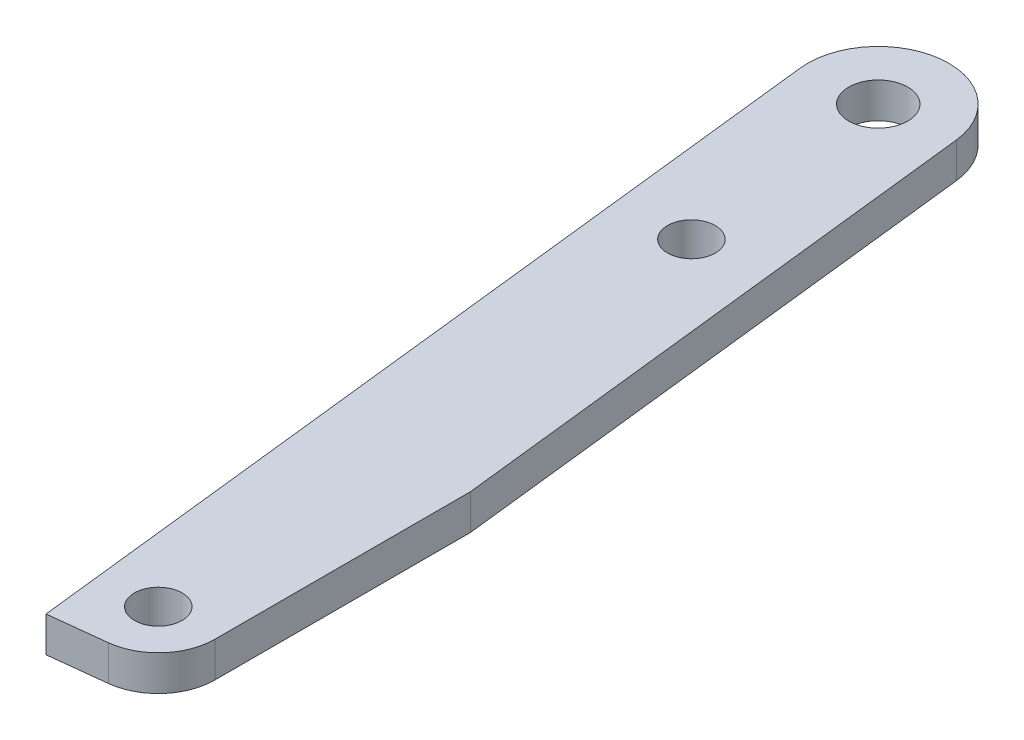
ISO-10303-21;
HEADER;
FILE_DESCRIPTION(('STEP AP214'),'2;1');
FILE_NAME('part.step','',(''),(''),'','','');
FILE_SCHEMA(('AUTOMOTIVE_DESIGN { 1 0 10303 214 1 1 1 1 }'));
ENDSEC;
DATA;
#1=APPLICATION_CONTEXT('core data for automotive mechanical design processes');
#2=APPLICATION_PROTOCOL_DEFINITION('international standard','automotive_design',2000,#1);
#3=PRODUCT_CONTEXT('',#1,'mechanical');
#4=PRODUCT('Part','Part','',(#3));
#5=PRODUCT_RELATED_PRODUCT_CATEGORY('part','',(#4));
#6=PRODUCT_DEFINITION_FORMATION('','',#4);
#7=PRODUCT_DEFINITION_CONTEXT('part definition',#1,'design');
#8=PRODUCT_DEFINITION('design','',#6,#7);
#9=PRODUCT_DEFINITION_SHAPE('','',#8);
#10=(LENGTH_UNIT() NAMED_UNIT(*) SI_UNIT(.MILLI.,.METRE.));
#11=(NAMED_UNIT(*) PLANE_ANGLE_UNIT() SI_UNIT($,.RADIAN.));
#12=(NAMED_UNIT(*) SI_UNIT($,.STERADIAN.) SOLID_ANGLE_UNIT());
#13=UNCERTAINTY_MEASURE_WITH_UNIT(LENGTH_MEASURE(1.E-05),#10,'distance_accuracy_value','');
#14=(GEOMETRIC_REPRESENTATION_CONTEXT(3) GLOBAL_UNCERTAINTY_ASSIGNED_CONTEXT((#13)) GLOBAL_UNIT_ASSIGNED_CONTEXT((#10,
#11,#12)) REPRESENTATION_CONTEXT('',''));
#15=CARTESIAN_POINT('',(0.,0.,0.));
#16=DIRECTION('',(0.,0.,1.));
#17=DIRECTION('',(1.,0.,0.));
#18=AXIS2_PLACEMENT_3D('',#15,#16,#17);
#19=CARTESIAN_POINT('',(-16.7204999999893,-18.4375000000001,72.4945922294544));
#20=DIRECTION('',(0.,1.,0.));
#21=DIRECTION('',(0.,0.,1.));
#22=AXIS2_PLACEMENT_3D('',#19,#20,#21);
#23=PLANE('',#22);
#24=CARTESIAN_POINT('',(-19.4709999999786,-18.4375000000001,37.1094));
#25=DIRECTION('',(0.,1.,0.));
#26=DIRECTION('',(0.,0.,1.));
#27=AXIS2_PLACEMENT_3D('',#24,#25,#26);
#28=CIRCLE('',#27,2.6543);
#29=CARTESIAN_POINT('',(-19.4709999999786,-18.4375000000001,39.7637));
#30=VERTEX_POINT('',#29);
#31=EDGE_CURVE('E105',#30,#30,#28,.T.);
#32=ORIENTED_EDGE('',*,*,#31,.T.);
#33=EDGE_LOOP('',(#32));
#34=FACE_BOUND('',#33,.T.);
#35=CARTESIAN_POINT('',(-17.3400495431374,-18.4375000000001,56.0398397293865));
#36=DIRECTION('',(0.,1.,0.));
#37=DIRECTION('',(0.,0.,1.));
#38=AXIS2_PLACEMENT_3D('',#35,#36,#37);
#39=CIRCLE('',#38,2.1463);
#40=CARTESIAN_POINT('',(-17.3400495431374,-18.4375000000001,58.1861397293865));
#41=VERTEX_POINT('',#40);
#42=EDGE_CURVE('E188',#41,#41,#39,.T.);
#43=ORIENTED_EDGE('',*,*,#42,.T.);
#44=EDGE_LOOP('',(#43));
#45=FACE_BOUND('',#44,.T.);
#46=CARTESIAN_POINT('',(-12.7000000000016,-18.4375000000001,108.613413739759));
#47=DIRECTION('',(0.,1.,0.));
#48=DIRECTION('',(0.,0.,1.));
#49=AXIS2_PLACEMENT_3D('',#46,#47,#48);
#50=CIRCLE('',#49,2.1463);
#51=CARTESIAN_POINT('',(-12.7000000000016,-18.4375000000001,110.759713739759));
#52=VERTEX_POINT('',#51);
#53=EDGE_CURVE('E113',#52,#52,#50,.T.);
#54=ORIENTED_EDGE('',*,*,#53,.T.);
#55=EDGE_LOOP('',(#54));
#56=FACE_BOUND('',#55,.T.);
#57=DIRECTION('',(-0.111860914179491,0.,-0.993723873054748));
#58=VECTOR('',#57,1.);
#59=CARTESIAN_POINT('',(-7.61999999999997,-18.4375000000001,85.6216230526662));
#60=LINE('',#59,#58);
#61=CARTESIAN_POINT('',(-7.61999999999998,-18.4375000000001,85.6216230526662));
#62=VERTEX_POINT('',#61);
#63=CARTESIAN_POINT('',(-13.1608534113733,-18.4375000000001,36.399083147946));
#64=VERTEX_POINT('',#63);
#65=EDGE_CURVE('E70',#62,#64,#60,.T.);
#66=ORIENTED_EDGE('',*,*,#65,.F.);
#67=DIRECTION('',(0.,0.,-1.));
#68=VECTOR('',#67,1.);
#69=CARTESIAN_POINT('',(-7.62000000000157,-18.4375000000001,108.613413739759));
#70=LINE('',#69,#68);
#71=CARTESIAN_POINT('',(-7.62000000000157,-18.4375000000001,108.61341373976));
#72=VERTEX_POINT('',#71);
#73=EDGE_CURVE('E111',#72,#62,#70,.T.);
#74=ORIENTED_EDGE('',*,*,#73,.F.);
#75=CARTESIAN_POINT('',(-12.7000000000016,-18.4375000000001,108.613413739759));
#76=DIRECTION('',(0.,1.,0.));
#77=DIRECTION('',(0.,0.,1.));
#78=AXIS2_PLACEMENT_3D('',#75,#76,#77);
#79=CIRCLE('',#78,5.08);
#80=CARTESIAN_POINT('',(-12.1317465559699,-18.4375000000001,113.661531014877));
#81=VERTEX_POINT('',#80);
#82=EDGE_CURVE('E145',#81,#72,#79,.T.);
#83=ORIENTED_EDGE('',*,*,#82,.F.);
#84=DIRECTION('',(0.99372387305475,0.,-0.11186091417947));
#85=VECTOR('',#84,1.);
#86=CARTESIAN_POINT('',(-17.179863831088,-18.4375000000001,114.229784458909));
#87=LINE('',#86,#85);
#88=CARTESIAN_POINT('',(-17.179863831088,-18.4375000000001,114.229784458909));
#89=VERTEX_POINT('',#88);
#90=EDGE_CURVE('E153',#89,#81,#87,.T.);
#91=ORIENTED_EDGE('',*,*,#90,.F.);
#92=DIRECTION('',(0.111860914179471,0.,0.99372387305475));
#93=VECTOR('',#92,1.);
#94=CARTESIAN_POINT('',(-25.7811465938762,-18.4375000000001,37.8197168050397));
#95=LINE('',#94,#93);
#96=CARTESIAN_POINT('',(-25.7811465960684,-18.4375000000001,37.8197167855657));
#97=VERTEX_POINT('',#96);
#98=EDGE_CURVE('E84',#97,#89,#95,.T.);
#99=ORIENTED_EDGE('',*,*,#98,.F.);
#100=CARTESIAN_POINT('',(-19.4709999999786,-18.4375000000001,37.1094));
#101=DIRECTION('',(0.,1.,0.));
#102=DIRECTION('',(0.,0.,1.));
#103=AXIS2_PLACEMENT_3D('',#100,#101,#102);
#104=CIRCLE('',#103,6.35);
#105=EDGE_CURVE('E20',#64,#97,#104,.T.);
#106=ORIENTED_EDGE('',*,*,#105,.F.);
#107=EDGE_LOOP('',(#66,#74,#83,#91,#99,#106));
#108=FACE_BOUND('',#107,.T.);
#109=ADVANCED_FACE('F17',(#34,#45,#56,#108),#23,.F.);
#110=CARTESIAN_POINT('',(-7.61999999999997,-18.4375000000001,85.6216230526662));
#111=DIRECTION('',(0.993723873054748,0.,-0.111860914179491));
#112=DIRECTION('',(-0.111860914179491,0.,-0.993723873054748));
#113=AXIS2_PLACEMENT_3D('',#110,#111,#112);
#114=PLANE('',#113);
#115=ORIENTED_EDGE('',*,*,#65,.T.);
#116=DIRECTION('',(0.,1.,0.));
#117=VECTOR('',#116,1.);
#118=CARTESIAN_POINT('',(-13.1608534166655,-18.4375000000001,36.3990831009318));
#119=LINE('',#118,#117);
#120=CARTESIAN_POINT('',(-13.1608534113733,-15.2624999999999,36.399083147946));
#121=VERTEX_POINT('',#120);
#122=EDGE_CURVE('E98',#121,#64,#119,.F.);
#123=ORIENTED_EDGE('',*,*,#122,.F.);
#124=DIRECTION('',(-0.111860914179491,0.,-0.993723873054748));
#125=VECTOR('',#124,1.);
#126=CARTESIAN_POINT('',(-7.61999999999997,-15.2624999999999,85.6216230526662));
#127=LINE('',#126,#125);
#128=CARTESIAN_POINT('',(-7.62000000000104,-15.2624999999999,85.6216230526567));
#129=VERTEX_POINT('',#128);
#130=EDGE_CURVE('E93',#129,#121,#127,.T.);
#131=ORIENTED_EDGE('',*,*,#130,.F.);
#132=DIRECTION('',(0.,1.,0.));
#133=VECTOR('',#132,1.);
#134=CARTESIAN_POINT('',(-7.61999999999998,-18.4375000000001,85.6216230526662));
#135=LINE('',#134,#133);
#136=EDGE_CURVE('E96',#62,#129,#135,.T.);
#137=ORIENTED_EDGE('',*,*,#136,.F.);
#138=EDGE_LOOP('',(#115,#123,#131,#137));
#139=FACE_BOUND('',#138,.T.);
#140=ADVANCED_FACE('F95',(#139),#114,.T.);
#141=CARTESIAN_POINT('',(-19.4709999999786,-18.4375000000001,37.1094));
#142=DIRECTION('',(0.,1.,0.));
#143=DIRECTION('',(0.,0.,1.));
#144=AXIS2_PLACEMENT_3D('',#141,#142,#143);
#145=CYLINDRICAL_SURFACE('',#144,6.35);
#146=ORIENTED_EDGE('',*,*,#105,.T.);
#147=DIRECTION('',(0.,1.,0.));
#148=VECTOR('',#147,1.);
#149=CARTESIAN_POINT('',(-25.7811465982605,-18.4375000000001,37.8197167660918));
#150=LINE('',#149,#148);
#151=CARTESIAN_POINT('',(-25.7811465960684,-15.2624999999999,37.8197167855657));
#152=VERTEX_POINT('',#151);
#153=EDGE_CURVE('E160',#152,#97,#150,.F.);
#154=ORIENTED_EDGE('',*,*,#153,.F.);
#155=CARTESIAN_POINT('',(-19.4709999999786,-15.2624999999999,37.1094));
#156=DIRECTION('',(0.,1.,0.));
#157=DIRECTION('',(0.,0.,1.));
#158=AXIS2_PLACEMENT_3D('',#155,#156,#157);
#159=CIRCLE('',#158,6.35);
#160=EDGE_CURVE('E104',#121,#152,#159,.T.);
#161=ORIENTED_EDGE('',*,*,#160,.F.);
#162=ORIENTED_EDGE('',*,*,#122,.T.);
#163=EDGE_LOOP('',(#146,#154,#161,#162));
#164=FACE_BOUND('',#163,.T.);
#165=ADVANCED_FACE('F203',(#164),#145,.T.);
#166=CARTESIAN_POINT('',(-25.7811465938762,-18.4375000000001,37.8197168050397));
#167=DIRECTION('',(-0.99372387305475,0.,0.111860914179471));
#168=DIRECTION('',(0.111860914179471,0.,0.99372387305475));
#169=AXIS2_PLACEMENT_3D('',#166,#167,#168);
#170=PLANE('',#169);
#171=ORIENTED_EDGE('',*,*,#98,.T.);
#172=DIRECTION('',(0.,1.,0.));
#173=VECTOR('',#172,1.);
#174=CARTESIAN_POINT('',(-17.179863831088,-18.4375000000001,114.229784458909));
#175=LINE('',#174,#173);
#176=CARTESIAN_POINT('',(-17.179863831088,-15.2624999999999,114.229784458909));
#177=VERTEX_POINT('',#176);
#178=EDGE_CURVE('E154',#177,#89,#175,.F.);
#179=ORIENTED_EDGE('',*,*,#178,.F.);
#180=DIRECTION('',(0.11186091417947,0.,0.99372387305475));
#181=VECTOR('',#180,1.);
#182=CARTESIAN_POINT('',(-25.7811465982605,-15.2624999999999,37.8197167660918));
#183=LINE('',#182,#181);
#184=EDGE_CURVE('E134',#152,#177,#183,.T.);
#185=ORIENTED_EDGE('',*,*,#184,.F.);
#186=ORIENTED_EDGE('',*,*,#153,.T.);
#187=EDGE_LOOP('',(#171,#179,#185,#186));
#188=FACE_BOUND('',#187,.T.);
#189=ADVANCED_FACE('F231',(#188),#170,.T.);
#190=CARTESIAN_POINT('',(-17.179863831088,-18.4375000000001,114.229784458909));
#191=DIRECTION('',(0.11186091417947,0.,0.99372387305475));
#192=DIRECTION('',(0.99372387305475,0.,-0.11186091417947));
#193=AXIS2_PLACEMENT_3D('',#190,#191,#192);
#194=PLANE('',#193);
#195=ORIENTED_EDGE('',*,*,#90,.T.);
#196=DIRECTION('',(0.,1.,0.));
#197=VECTOR('',#196,1.);
#198=CARTESIAN_POINT('',(-12.1317465559698,-18.4375000000001,113.661531014878));
#199=LINE('',#198,#197);
#200=CARTESIAN_POINT('',(-12.1317465559699,-15.2624999999999,113.661531014878));
#201=VERTEX_POINT('',#200);
#202=EDGE_CURVE('E149',#201,#81,#199,.F.);
#203=ORIENTED_EDGE('',*,*,#202,.F.);
#204=DIRECTION('',(0.993723873054753,0.,-0.11186091417945));
#205=VECTOR('',#204,1.);
#206=CARTESIAN_POINT('',(-17.179863831088,-15.2624999999999,114.229784458909));
#207=LINE('',#206,#205);
#208=EDGE_CURVE('E127',#177,#201,#207,.T.);
#209=ORIENTED_EDGE('',*,*,#208,.F.);
#210=ORIENTED_EDGE('',*,*,#178,.T.);
#211=EDGE_LOOP('',(#195,#203,#209,#210));
#212=FACE_BOUND('',#211,.T.);
#213=ADVANCED_FACE('F228',(#212),#194,.T.);
#214=CARTESIAN_POINT('',(-12.7000000000016,-18.4375000000001,108.613413739759));
#215=DIRECTION('',(0.,1.,0.));
#216=DIRECTION('',(0.,0.,1.));
#217=AXIS2_PLACEMENT_3D('',#214,#215,#216);
#218=CYLINDRICAL_SURFACE('',#217,5.08);
#219=ORIENTED_EDGE('',*,*,#82,.T.);
#220=DIRECTION('',(0.,1.,0.));
#221=VECTOR('',#220,1.);
#222=CARTESIAN_POINT('',(-7.62000000000157,-18.4375000000001,108.613413739759));
#223=LINE('',#222,#221);
#224=CARTESIAN_POINT('',(-7.62000000000157,-15.2624999999999,108.613413739759));
#225=VERTEX_POINT('',#224);
#226=EDGE_CURVE('E40',#225,#72,#223,.F.);
#227=ORIENTED_EDGE('',*,*,#226,.F.);
#228=CARTESIAN_POINT('',(-12.7000000000016,-15.2624999999999,108.613413739759));
#229=DIRECTION('',(0.,1.,0.));
#230=DIRECTION('',(0.,0.,1.));
#231=AXIS2_PLACEMENT_3D('',#228,#229,#230);
#232=CIRCLE('',#231,5.08);
#233=EDGE_CURVE('E117',#201,#225,#232,.T.);
#234=ORIENTED_EDGE('',*,*,#233,.F.);
#235=ORIENTED_EDGE('',*,*,#202,.T.);
#236=EDGE_LOOP('',(#219,#227,#234,#235));
#237=FACE_BOUND('',#236,.T.);
#238=ADVANCED_FACE('F196',(#237),#218,.T.);
#239=CARTESIAN_POINT('',(-7.62000000000157,-18.4375000000001,108.613413739759));
#240=DIRECTION('',(1.,0.,0.));
#241=DIRECTION('',(0.,0.,-1.));
#242=AXIS2_PLACEMENT_3D('',#239,#240,#241);
#243=PLANE('',#242);
#244=ORIENTED_EDGE('',*,*,#73,.T.);
#245=ORIENTED_EDGE('',*,*,#136,.T.);
#246=DIRECTION('',(0.,0.,1.));
#247=VECTOR('',#246,1.);
#248=CARTESIAN_POINT('',(-7.62000000000157,-15.2624999999999,72.4945922294544));
#249=LINE('',#248,#247);
#250=EDGE_CURVE('E109',#225,#129,#249,.F.);
#251=ORIENTED_EDGE('',*,*,#250,.F.);
#252=ORIENTED_EDGE('',*,*,#226,.T.);
#253=EDGE_LOOP('',(#244,#245,#251,#252));
#254=FACE_BOUND('',#253,.T.);
#255=ADVANCED_FACE('F108',(#254),#243,.T.);
#256=CARTESIAN_POINT('',(-12.7000000000016,-2.85875000000017,108.613413739759));
#257=DIRECTION('',(0.,1.,0.));
#258=DIRECTION('',(0.,0.,1.));
#259=AXIS2_PLACEMENT_3D('',#256,#257,#258);
#260=CYLINDRICAL_SURFACE('',#259,2.1463);
#261=CARTESIAN_POINT('',(-12.7000000000016,-15.2624999999999,108.613413739759));
#262=DIRECTION('',(0.,1.,0.));
#263=DIRECTION('',(0.,0.,1.));
#264=AXIS2_PLACEMENT_3D('',#261,#262,#263);
#265=CIRCLE('',#264,2.1463);
#266=CARTESIAN_POINT('',(-12.7000000000016,-15.2624999999999,110.759713739759));
#267=VERTEX_POINT('',#266);
#268=EDGE_CURVE('E119',#267,#267,#265,.F.);
#269=ORIENTED_EDGE('',*,*,#268,.F.);
#270=EDGE_LOOP('',(#269));
#271=FACE_BOUND('',#270,.T.);
#272=ORIENTED_EDGE('',*,*,#53,.F.);
#273=EDGE_LOOP('',(#272));
#274=FACE_BOUND('',#273,.T.);
#275=ADVANCED_FACE('F219',(#271,#274),#260,.F.);
#276=CARTESIAN_POINT('',(-17.3400495431374,-2.85875000000017,56.0398397293865));
#277=DIRECTION('',(0.,1.,0.));
#278=DIRECTION('',(0.,0.,1.));
#279=AXIS2_PLACEMENT_3D('',#276,#277,#278);
#280=CYLINDRICAL_SURFACE('',#279,2.1463);
#281=CARTESIAN_POINT('',(-17.3400495431374,-15.2624999999999,56.0398397293865));
#282=DIRECTION('',(0.,1.,0.));
#283=DIRECTION('',(0.,0.,1.));
#284=AXIS2_PLACEMENT_3D('',#281,#282,#283);
#285=CIRCLE('',#284,2.1463);
#286=CARTESIAN_POINT('',(-17.3400495431374,-15.2624999999999,58.1861397293865));
#287=VERTEX_POINT('',#286);
#288=EDGE_CURVE('E27',#287,#287,#285,.F.);
#289=ORIENTED_EDGE('',*,*,#288,.F.);
#290=EDGE_LOOP('',(#289));
#291=FACE_BOUND('',#290,.T.);
#292=ORIENTED_EDGE('',*,*,#42,.F.);
#293=EDGE_LOOP('',(#292));
#294=FACE_BOUND('',#293,.T.);
#295=ADVANCED_FACE('F212',(#291,#294),#280,.F.);
#296=CARTESIAN_POINT('',(-19.4709999999786,-18.4375000000001,37.1094));
#297=DIRECTION('',(0.,1.,0.));
#298=DIRECTION('',(0.,0.,1.));
#299=AXIS2_PLACEMENT_3D('',#296,#297,#298);
#300=CYLINDRICAL_SURFACE('',#299,2.6543);
#301=ORIENTED_EDGE('',*,*,#31,.F.);
#302=EDGE_LOOP('',(#301));
#303=FACE_BOUND('',#302,.T.);
#304=CARTESIAN_POINT('',(-19.4709999999786,-15.2624999999999,37.1094));
#305=DIRECTION('',(0.,1.,0.));
#306=DIRECTION('',(0.,0.,1.));
#307=AXIS2_PLACEMENT_3D('',#304,#305,#306);
#308=CIRCLE('',#307,2.6543);
#309=CARTESIAN_POINT('',(-19.4709999999786,-15.2624999999999,39.7637));
#310=VERTEX_POINT('',#309);
#311=EDGE_CURVE('E11',#310,#310,#308,.F.);
#312=ORIENTED_EDGE('',*,*,#311,.F.);
#313=EDGE_LOOP('',(#312));
#314=FACE_BOUND('',#313,.T.);
#315=ADVANCED_FACE('F206',(#303,#314),#300,.F.);
#316=CARTESIAN_POINT('',(-16.7204999999893,-15.2624999999999,72.4945922294544));
#317=DIRECTION('',(0.,1.,0.));
#318=DIRECTION('',(0.,0.,1.));
#319=AXIS2_PLACEMENT_3D('',#316,#317,#318);
#320=PLANE('',#319);
#321=ORIENTED_EDGE('',*,*,#311,.T.);
#322=EDGE_LOOP('',(#321));
#323=FACE_BOUND('',#322,.T.);
#324=ORIENTED_EDGE('',*,*,#288,.T.);
#325=EDGE_LOOP('',(#324));
#326=FACE_BOUND('',#325,.T.);
#327=ORIENTED_EDGE('',*,*,#268,.T.);
#328=EDGE_LOOP('',(#327));
#329=FACE_BOUND('',#328,.T.);
#330=ORIENTED_EDGE('',*,*,#233,.T.);
#331=ORIENTED_EDGE('',*,*,#250,.T.);
#332=ORIENTED_EDGE('',*,*,#130,.T.);
#333=ORIENTED_EDGE('',*,*,#160,.T.);
#334=ORIENTED_EDGE('',*,*,#184,.T.);
#335=ORIENTED_EDGE('',*,*,#208,.T.);
#336=EDGE_LOOP('',(#330,#331,#332,#333,#334,#335));
#337=FACE_BOUND('',#336,.T.);
#338=ADVANCED_FACE('F115',(#323,#326,#329,#337),#320,.T.);
#339=CLOSED_SHELL('',(#109,#140,#165,#189,#213,#238,#255,#275,#295,#315,#338));
#340=MANIFOLD_SOLID_BREP('B1',#339);
#341=ADVANCED_BREP_SHAPE_REPRESENTATION('',(#18,#340),#14);
#342=SHAPE_DEFINITION_REPRESENTATION(#9,#341);
ENDSEC;
END-ISO-10303-21;
